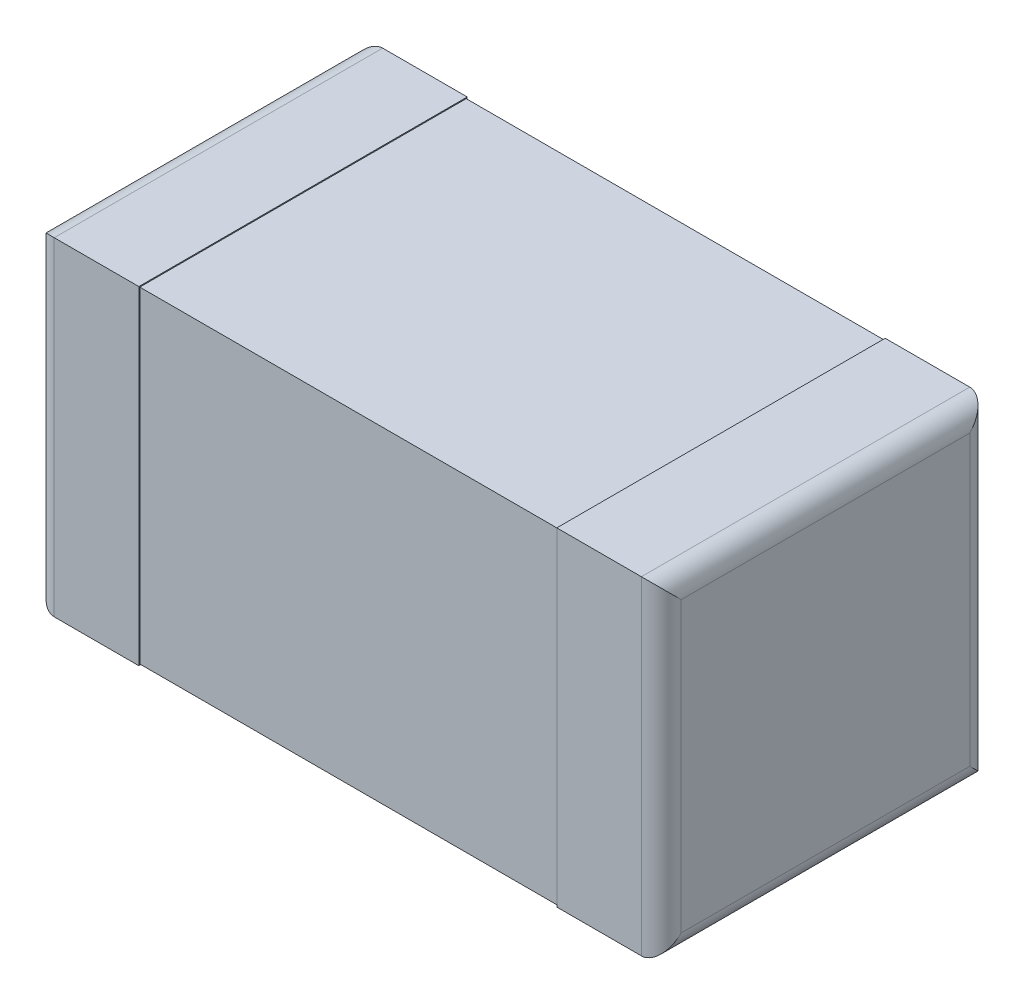
ISO-10303-21;
HEADER;
FILE_DESCRIPTION(('STEP AP214'),'2;1');
FILE_NAME('part.step','',(''),(''),'','','');
FILE_SCHEMA(('AUTOMOTIVE_DESIGN { 1 0 10303 214 1 1 1 1 }'));
ENDSEC;
DATA;
#1=APPLICATION_CONTEXT('core data for automotive mechanical design processes');
#2=APPLICATION_PROTOCOL_DEFINITION('international standard','automotive_design',2000,#1);
#3=PRODUCT_CONTEXT('',#1,'mechanical');
#4=PRODUCT('Part','Part','',(#3));
#5=PRODUCT_RELATED_PRODUCT_CATEGORY('part','',(#4));
#6=PRODUCT_DEFINITION_FORMATION('','',#4);
#7=PRODUCT_DEFINITION_CONTEXT('part definition',#1,'design');
#8=PRODUCT_DEFINITION('design','',#6,#7);
#9=PRODUCT_DEFINITION_SHAPE('','',#8);
#10=(LENGTH_UNIT() NAMED_UNIT(*) SI_UNIT(.MILLI.,.METRE.));
#11=(NAMED_UNIT(*) PLANE_ANGLE_UNIT() SI_UNIT($,.RADIAN.));
#12=(NAMED_UNIT(*) SI_UNIT($,.STERADIAN.) SOLID_ANGLE_UNIT());
#13=UNCERTAINTY_MEASURE_WITH_UNIT(LENGTH_MEASURE(1.E-05),#10,'distance_accuracy_value','');
#14=(GEOMETRIC_REPRESENTATION_CONTEXT(3) GLOBAL_UNCERTAINTY_ASSIGNED_CONTEXT((#13)) GLOBAL_UNIT_ASSIGNED_CONTEXT((#10,
#11,#12)) REPRESENTATION_CONTEXT('',''));
#15=CARTESIAN_POINT('',(0.,0.,0.));
#16=DIRECTION('',(0.,0.,1.));
#17=DIRECTION('',(1.,0.,0.));
#18=AXIS2_PLACEMENT_3D('',#15,#16,#17);
#19=CARTESIAN_POINT('',(0.,0.,0.));
#20=DIRECTION('',(0.,0.,1.));
#21=DIRECTION('',(1.,0.,0.));
#22=AXIS2_PLACEMENT_3D('',#19,#20,#21);
#23=PLANE('',#22);
#24=DIRECTION('',(-1.,0.,0.));
#25=VECTOR('',#24,1.);
#26=CARTESIAN_POINT('',(1.6002,0.8382,0.));
#27=LINE('',#26,#25);
#28=CARTESIAN_POINT('',(1.5494,0.8382,0.));
#29=VERTEX_POINT('',#28);
#30=CARTESIAN_POINT('',(1.3335,0.8382,0.));
#31=VERTEX_POINT('',#30);
#32=EDGE_CURVE('E42',#29,#31,#27,.T.);
#33=ORIENTED_EDGE('',*,*,#32,.F.);
#34=DIRECTION('',(0.,-1.,0.));
#35=VECTOR('',#34,1.);
#36=CARTESIAN_POINT('',(1.5494,0.,0.));
#37=LINE('',#36,#35);
#38=CARTESIAN_POINT('',(1.5494,0.,0.));
#39=VERTEX_POINT('',#38);
#40=EDGE_CURVE('E11',#29,#39,#37,.T.);
#41=ORIENTED_EDGE('',*,*,#40,.T.);
#42=DIRECTION('',(1.,0.,0.));
#43=VECTOR('',#42,1.);
#44=CARTESIAN_POINT('',(0.,0.,0.));
#45=LINE('',#44,#43);
#46=CARTESIAN_POINT('',(1.3335,0.,0.));
#47=VERTEX_POINT('',#46);
#48=EDGE_CURVE('E196',#47,#39,#45,.T.);
#49=ORIENTED_EDGE('',*,*,#48,.F.);
#50=DIRECTION('',(0.,1.,0.));
#51=VECTOR('',#50,1.);
#52=CARTESIAN_POINT('',(1.3335,0.,0.));
#53=LINE('',#52,#51);
#54=EDGE_CURVE('E29',#47,#31,#53,.T.);
#55=ORIENTED_EDGE('',*,*,#54,.T.);
#56=EDGE_LOOP('',(#33,#41,#49,#55));
#57=FACE_BOUND('',#56,.T.);
#58=ADVANCED_FACE('F18',(#57),#23,.F.);
#59=CARTESIAN_POINT('',(0.,0.,0.));
#60=DIRECTION('',(0.,0.,1.));
#61=DIRECTION('',(1.,0.,0.));
#62=AXIS2_PLACEMENT_3D('',#59,#60,#61);
#63=PLANE('',#62);
#64=DIRECTION('',(1.,0.,0.));
#65=VECTOR('',#64,1.);
#66=CARTESIAN_POINT('',(0.,0.,0.));
#67=LINE('',#66,#65);
#68=CARTESIAN_POINT('',(0.0508,0.,0.));
#69=VERTEX_POINT('',#68);
#70=CARTESIAN_POINT('',(0.2667,0.,0.));
#71=VERTEX_POINT('',#70);
#72=EDGE_CURVE('E268',#69,#71,#67,.T.);
#73=ORIENTED_EDGE('',*,*,#72,.F.);
#74=DIRECTION('',(0.,1.,0.));
#75=VECTOR('',#74,1.);
#76=CARTESIAN_POINT('',(0.0508,0.,0.));
#77=LINE('',#76,#75);
#78=CARTESIAN_POINT('',(0.0508,0.8382,0.));
#79=VERTEX_POINT('',#78);
#80=EDGE_CURVE('E290',#69,#79,#77,.T.);
#81=ORIENTED_EDGE('',*,*,#80,.T.);
#82=DIRECTION('',(-1.,0.,0.));
#83=VECTOR('',#82,1.);
#84=CARTESIAN_POINT('',(1.6002,0.8382,0.));
#85=LINE('',#84,#83);
#86=CARTESIAN_POINT('',(0.2667,0.8382,0.));
#87=VERTEX_POINT('',#86);
#88=EDGE_CURVE('E200',#87,#79,#85,.T.);
#89=ORIENTED_EDGE('',*,*,#88,.F.);
#90=DIRECTION('',(0.,-1.,0.));
#91=VECTOR('',#90,1.);
#92=CARTESIAN_POINT('',(0.2667,0.,0.));
#93=LINE('',#92,#91);
#94=EDGE_CURVE('E276',#87,#71,#93,.T.);
#95=ORIENTED_EDGE('',*,*,#94,.T.);
#96=EDGE_LOOP('',(#73,#81,#89,#95));
#97=FACE_BOUND('',#96,.T.);
#98=ADVANCED_FACE('F350',(#97),#63,.F.);
#99=CARTESIAN_POINT('',(1.3335,0.00254,-1.15577127423469));
#100=DIRECTION('',(0.,1.,0.));
#101=DIRECTION('',(1.,0.,0.));
#102=AXIS2_PLACEMENT_3D('',#99,#100,#101);
#103=PLANE('',#102);
#104=DIRECTION('',(-1.,0.,0.));
#105=VECTOR('',#104,1.);
#106=CARTESIAN_POINT('',(1.3335,0.00254,0.00253999999999988));
#107=LINE('',#106,#105);
#108=CARTESIAN_POINT('',(1.3335,0.00254000000000009,0.0025399999999999));
#109=VERTEX_POINT('',#108);
#110=CARTESIAN_POINT('',(0.2667,0.00254000000000009,0.0025399999999999));
#111=VERTEX_POINT('',#110);
#112=EDGE_CURVE('E226',#109,#111,#107,.T.);
#113=ORIENTED_EDGE('',*,*,#112,.F.);
#114=DIRECTION('',(0.,0.,1.));
#115=VECTOR('',#114,1.);
#116=CARTESIAN_POINT('',(1.3335,0.00254,-1.15577127423469));
#117=LINE('',#116,#115);
#118=CARTESIAN_POINT('',(1.3335,0.00254,0.83566));
#119=VERTEX_POINT('',#118);
#120=EDGE_CURVE('E272',#109,#119,#117,.T.);
#121=ORIENTED_EDGE('',*,*,#120,.T.);
#122=DIRECTION('',(-1.,0.,0.));
#123=VECTOR('',#122,1.);
#124=CARTESIAN_POINT('',(1.3335,0.00254,0.83566));
#125=LINE('',#124,#123);
#126=CARTESIAN_POINT('',(0.2667,0.00253999999999988,0.83566));
#127=VERTEX_POINT('',#126);
#128=EDGE_CURVE('E277',#119,#127,#125,.T.);
#129=ORIENTED_EDGE('',*,*,#128,.T.);
#130=DIRECTION('',(0.,0.,1.));
#131=VECTOR('',#130,1.);
#132=CARTESIAN_POINT('',(0.2667,0.00253999999999988,-1.15577127423469));
#133=LINE('',#132,#131);
#134=EDGE_CURVE('E434',#111,#127,#133,.T.);
#135=ORIENTED_EDGE('',*,*,#134,.F.);
#136=EDGE_LOOP('',(#113,#121,#129,#135));
#137=FACE_BOUND('',#136,.T.);
#138=ADVANCED_FACE('F355',(#137),#103,.F.);
#139=CARTESIAN_POINT('',(0.2667,0.83566,-1.15577127423469));
#140=DIRECTION('',(0.,-1.,0.));
#141=DIRECTION('',(0.,0.,-1.));
#142=AXIS2_PLACEMENT_3D('',#139,#140,#141);
#143=PLANE('',#142);
#144=DIRECTION('',(1.,0.,0.));
#145=VECTOR('',#144,1.);
#146=CARTESIAN_POINT('',(0.2667,0.83566,0.00253999999999988));
#147=LINE('',#146,#145);
#148=CARTESIAN_POINT('',(0.2667,0.83566,0.0025399999999999));
#149=VERTEX_POINT('',#148);
#150=CARTESIAN_POINT('',(1.3335,0.83566,0.0025399999999999));
#151=VERTEX_POINT('',#150);
#152=EDGE_CURVE('E247',#149,#151,#147,.T.);
#153=ORIENTED_EDGE('',*,*,#152,.F.);
#154=DIRECTION('',(0.,0.,1.));
#155=VECTOR('',#154,1.);
#156=CARTESIAN_POINT('',(0.2667,0.83566,-1.15577127423469));
#157=LINE('',#156,#155);
#158=CARTESIAN_POINT('',(0.2667,0.83566,0.83566));
#159=VERTEX_POINT('',#158);
#160=EDGE_CURVE('E445',#149,#159,#157,.T.);
#161=ORIENTED_EDGE('',*,*,#160,.T.);
#162=DIRECTION('',(1.,0.,0.));
#163=VECTOR('',#162,1.);
#164=CARTESIAN_POINT('',(0.2667,0.83566,0.83566));
#165=LINE('',#164,#163);
#166=CARTESIAN_POINT('',(1.3335,0.83566,0.83566));
#167=VERTEX_POINT('',#166);
#168=EDGE_CURVE('E264',#159,#167,#165,.T.);
#169=ORIENTED_EDGE('',*,*,#168,.T.);
#170=DIRECTION('',(0.,0.,1.));
#171=VECTOR('',#170,1.);
#172=CARTESIAN_POINT('',(1.3335,0.83566,-1.15577127423469));
#173=LINE('',#172,#171);
#174=EDGE_CURVE('E235',#151,#167,#173,.T.);
#175=ORIENTED_EDGE('',*,*,#174,.F.);
#176=EDGE_LOOP('',(#153,#161,#169,#175));
#177=FACE_BOUND('',#176,.T.);
#178=ADVANCED_FACE('F386',(#177),#143,.F.);
#179=CARTESIAN_POINT('',(1.6002,0.8382,0.8382));
#180=DIRECTION('',(0.,-1.,0.));
#181=DIRECTION('',(0.,0.,-1.));
#182=AXIS2_PLACEMENT_3D('',#179,#180,#181);
#183=PLANE('',#182);
#184=DIRECTION('',(-1.,0.,0.));
#185=VECTOR('',#184,1.);
#186=CARTESIAN_POINT('',(1.6002,0.8382,0.8382));
#187=LINE('',#186,#185);
#188=CARTESIAN_POINT('',(1.5494,0.8382,0.8382));
#189=VERTEX_POINT('',#188);
#190=CARTESIAN_POINT('',(1.3335,0.8382,0.8382));
#191=VERTEX_POINT('',#190);
#192=EDGE_CURVE('E180',#189,#191,#187,.T.);
#193=ORIENTED_EDGE('',*,*,#192,.F.);
#194=DIRECTION('',(0.,0.,-1.));
#195=VECTOR('',#194,1.);
#196=CARTESIAN_POINT('',(1.5494,0.8382,0.8382));
#197=LINE('',#196,#195);
#198=EDGE_CURVE('E261',#189,#29,#197,.T.);
#199=ORIENTED_EDGE('',*,*,#198,.T.);
#200=ORIENTED_EDGE('',*,*,#32,.T.);
#201=DIRECTION('',(0.,0.,1.));
#202=VECTOR('',#201,1.);
#203=CARTESIAN_POINT('',(1.3335,0.8382,0.83566));
#204=LINE('',#203,#202);
#205=EDGE_CURVE('E236',#31,#191,#204,.T.);
#206=ORIENTED_EDGE('',*,*,#205,.T.);
#207=EDGE_LOOP('',(#193,#199,#200,#206));
#208=FACE_BOUND('',#207,.T.);
#209=ADVANCED_FACE('F284',(#208),#183,.F.);
#210=CARTESIAN_POINT('',(0.,0.,0.8382));
#211=DIRECTION('',(0.,1.,0.));
#212=DIRECTION('',(1.,0.,0.));
#213=AXIS2_PLACEMENT_3D('',#210,#211,#212);
#214=PLANE('',#213);
#215=DIRECTION('',(1.,0.,0.));
#216=VECTOR('',#215,1.);
#217=CARTESIAN_POINT('',(0.,0.,0.8382));
#218=LINE('',#217,#216);
#219=CARTESIAN_POINT('',(0.0508,0.,0.8382));
#220=VERTEX_POINT('',#219);
#221=CARTESIAN_POINT('',(0.2667,0.,0.8382));
#222=VERTEX_POINT('',#221);
#223=EDGE_CURVE('E221',#220,#222,#218,.T.);
#224=ORIENTED_EDGE('',*,*,#223,.F.);
#225=DIRECTION('',(0.,0.,-1.));
#226=VECTOR('',#225,1.);
#227=CARTESIAN_POINT('',(0.0508,0.,0.8382));
#228=LINE('',#227,#226);
#229=EDGE_CURVE('E239',#220,#69,#228,.T.);
#230=ORIENTED_EDGE('',*,*,#229,.T.);
#231=ORIENTED_EDGE('',*,*,#72,.T.);
#232=DIRECTION('',(0.,0.,1.));
#233=VECTOR('',#232,1.);
#234=CARTESIAN_POINT('',(0.2667,0.,0.83566));
#235=LINE('',#234,#233);
#236=EDGE_CURVE('E279',#71,#222,#235,.T.);
#237=ORIENTED_EDGE('',*,*,#236,.T.);
#238=EDGE_LOOP('',(#224,#230,#231,#237));
#239=FACE_BOUND('',#238,.T.);
#240=ADVANCED_FACE('F401',(#239),#214,.F.);
#241=CARTESIAN_POINT('',(0.,0.,0.8382));
#242=DIRECTION('',(0.,1.,0.));
#243=DIRECTION('',(1.,0.,0.));
#244=AXIS2_PLACEMENT_3D('',#241,#242,#243);
#245=PLANE('',#244);
#246=ORIENTED_EDGE('',*,*,#48,.T.);
#247=DIRECTION('',(0.,0.,1.));
#248=VECTOR('',#247,1.);
#249=CARTESIAN_POINT('',(1.5494,0.,0.8382));
#250=LINE('',#249,#248);
#251=CARTESIAN_POINT('',(1.5494,0.,0.8382));
#252=VERTEX_POINT('',#251);
#253=EDGE_CURVE('E194',#39,#252,#250,.T.);
#254=ORIENTED_EDGE('',*,*,#253,.T.);
#255=DIRECTION('',(1.,0.,0.));
#256=VECTOR('',#255,1.);
#257=CARTESIAN_POINT('',(0.,0.,0.8382));
#258=LINE('',#257,#256);
#259=CARTESIAN_POINT('',(1.3335,0.,0.8382));
#260=VERTEX_POINT('',#259);
#261=EDGE_CURVE('E179',#260,#252,#258,.T.);
#262=ORIENTED_EDGE('',*,*,#261,.F.);
#263=DIRECTION('',(0.,0.,1.));
#264=VECTOR('',#263,1.);
#265=CARTESIAN_POINT('',(1.3335,0.,0.83566));
#266=LINE('',#265,#264);
#267=EDGE_CURVE('E223',#47,#260,#266,.T.);
#268=ORIENTED_EDGE('',*,*,#267,.F.);
#269=EDGE_LOOP('',(#246,#254,#262,#268));
#270=FACE_BOUND('',#269,.T.);
#271=ADVANCED_FACE('F20',(#270),#245,.F.);
#272=CARTESIAN_POINT('',(1.6002,0.8382,0.8382));
#273=DIRECTION('',(0.,-1.,0.));
#274=DIRECTION('',(0.,0.,-1.));
#275=AXIS2_PLACEMENT_3D('',#272,#273,#274);
#276=PLANE('',#275);
#277=ORIENTED_EDGE('',*,*,#88,.T.);
#278=DIRECTION('',(0.,0.,1.));
#279=VECTOR('',#278,1.);
#280=CARTESIAN_POINT('',(0.0508,0.8382,0.8382));
#281=LINE('',#280,#279);
#282=CARTESIAN_POINT('',(0.0508,0.8382,0.8382));
#283=VERTEX_POINT('',#282);
#284=EDGE_CURVE('E22',#79,#283,#281,.T.);
#285=ORIENTED_EDGE('',*,*,#284,.T.);
#286=DIRECTION('',(-1.,0.,0.));
#287=VECTOR('',#286,1.);
#288=CARTESIAN_POINT('',(1.6002,0.8382,0.8382));
#289=LINE('',#288,#287);
#290=CARTESIAN_POINT('',(0.2667,0.8382,0.8382));
#291=VERTEX_POINT('',#290);
#292=EDGE_CURVE('E269',#291,#283,#289,.T.);
#293=ORIENTED_EDGE('',*,*,#292,.F.);
#294=DIRECTION('',(0.,0.,1.));
#295=VECTOR('',#294,1.);
#296=CARTESIAN_POINT('',(0.2667,0.8382,0.83566));
#297=LINE('',#296,#295);
#298=EDGE_CURVE('E94',#87,#291,#297,.T.);
#299=ORIENTED_EDGE('',*,*,#298,.F.);
#300=EDGE_LOOP('',(#277,#285,#293,#299));
#301=FACE_BOUND('',#300,.T.);
#302=ADVANCED_FACE('F369',(#301),#276,.F.);
#303=CARTESIAN_POINT('',(0.,0.,0.8382));
#304=DIRECTION('',(0.,0.,1.));
#305=DIRECTION('',(1.,0.,0.));
#306=AXIS2_PLACEMENT_3D('',#303,#304,#305);
#307=PLANE('',#306);
#308=ORIENTED_EDGE('',*,*,#292,.T.);
#309=DIRECTION('',(0.,-1.,0.));
#310=VECTOR('',#309,1.);
#311=CARTESIAN_POINT('',(0.0508,0.,0.8382));
#312=LINE('',#311,#310);
#313=EDGE_CURVE('E77',#283,#220,#312,.T.);
#314=ORIENTED_EDGE('',*,*,#313,.T.);
#315=ORIENTED_EDGE('',*,*,#223,.T.);
#316=DIRECTION('',(0.,1.,0.));
#317=VECTOR('',#316,1.);
#318=CARTESIAN_POINT('',(0.2667,0.,0.8382));
#319=LINE('',#318,#317);
#320=EDGE_CURVE('E191',#222,#291,#319,.T.);
#321=ORIENTED_EDGE('',*,*,#320,.T.);
#322=EDGE_LOOP('',(#308,#314,#315,#321));
#323=FACE_BOUND('',#322,.T.);
#324=ADVANCED_FACE('F371',(#323),#307,.T.);
#325=CARTESIAN_POINT('',(0.,0.,0.8382));
#326=DIRECTION('',(0.,0.,1.));
#327=DIRECTION('',(1.,0.,0.));
#328=AXIS2_PLACEMENT_3D('',#325,#326,#327);
#329=PLANE('',#328);
#330=ORIENTED_EDGE('',*,*,#261,.T.);
#331=DIRECTION('',(0.,1.,0.));
#332=VECTOR('',#331,1.);
#333=CARTESIAN_POINT('',(1.5494,0.8382,0.8382));
#334=LINE('',#333,#332);
#335=EDGE_CURVE('E169',#252,#189,#334,.T.);
#336=ORIENTED_EDGE('',*,*,#335,.T.);
#337=ORIENTED_EDGE('',*,*,#192,.T.);
#338=DIRECTION('',(0.,-1.,0.));
#339=VECTOR('',#338,1.);
#340=CARTESIAN_POINT('',(1.3335,0.8382,0.8382));
#341=LINE('',#340,#339);
#342=EDGE_CURVE('E187',#191,#260,#341,.T.);
#343=ORIENTED_EDGE('',*,*,#342,.T.);
#344=EDGE_LOOP('',(#330,#336,#337,#343));
#345=FACE_BOUND('',#344,.T.);
#346=ADVANCED_FACE('F185',(#345),#329,.T.);
#347=CARTESIAN_POINT('',(0.,0.8382,0.8382));
#348=DIRECTION('',(1.,0.,0.));
#349=DIRECTION('',(0.,1.,0.));
#350=AXIS2_PLACEMENT_3D('',#347,#348,#349);
#351=PLANE('',#350);
#352=DIRECTION('',(0.,-1.,0.));
#353=VECTOR('',#352,1.);
#354=CARTESIAN_POINT('',(0.,0.8382,0.0508));
#355=LINE('',#354,#353);
#356=CARTESIAN_POINT('',(0.,0.7874,0.0508));
#357=VERTEX_POINT('',#356);
#358=CARTESIAN_POINT('',(0.,0.0508,0.0508));
#359=VERTEX_POINT('',#358);
#360=EDGE_CURVE('E256',#357,#359,#355,.T.);
#361=ORIENTED_EDGE('',*,*,#360,.T.);
#362=DIRECTION('',(0.,0.,1.));
#363=VECTOR('',#362,1.);
#364=CARTESIAN_POINT('',(0.,0.0508,0.8382));
#365=LINE('',#364,#363);
#366=CARTESIAN_POINT('',(0.,0.0508,0.7874));
#367=VERTEX_POINT('',#366);
#368=EDGE_CURVE('E413',#359,#367,#365,.T.);
#369=ORIENTED_EDGE('',*,*,#368,.T.);
#370=DIRECTION('',(0.,1.,0.));
#371=VECTOR('',#370,1.);
#372=CARTESIAN_POINT('',(0.,0.8382,0.7874));
#373=LINE('',#372,#371);
#374=CARTESIAN_POINT('',(0.,0.7874,0.7874));
#375=VERTEX_POINT('',#374);
#376=EDGE_CURVE('E230',#367,#375,#373,.T.);
#377=ORIENTED_EDGE('',*,*,#376,.T.);
#378=DIRECTION('',(0.,0.,-1.));
#379=VECTOR('',#378,1.);
#380=CARTESIAN_POINT('',(0.,0.7874,0.8382));
#381=LINE('',#380,#379);
#382=EDGE_CURVE('E227',#375,#357,#381,.T.);
#383=ORIENTED_EDGE('',*,*,#382,.T.);
#384=EDGE_LOOP('',(#361,#369,#377,#383));
#385=FACE_BOUND('',#384,.T.);
#386=ADVANCED_FACE('F376',(#385),#351,.F.);
#387=CARTESIAN_POINT('',(1.6002,0.,0.8382));
#388=DIRECTION('',(-1.,0.,0.));
#389=DIRECTION('',(0.,0.,1.));
#390=AXIS2_PLACEMENT_3D('',#387,#388,#389);
#391=PLANE('',#390);
#392=DIRECTION('',(0.,1.,0.));
#393=VECTOR('',#392,1.);
#394=CARTESIAN_POINT('',(1.6002,0.,0.0508));
#395=LINE('',#394,#393);
#396=CARTESIAN_POINT('',(1.6002,0.0508,0.0508));
#397=VERTEX_POINT('',#396);
#398=CARTESIAN_POINT('',(1.6002,0.7874,0.0508));
#399=VERTEX_POINT('',#398);
#400=EDGE_CURVE('E231',#397,#399,#395,.T.);
#401=ORIENTED_EDGE('',*,*,#400,.T.);
#402=DIRECTION('',(0.,0.,1.));
#403=VECTOR('',#402,1.);
#404=CARTESIAN_POINT('',(1.6002,0.7874,0.8382));
#405=LINE('',#404,#403);
#406=CARTESIAN_POINT('',(1.6002,0.7874,0.7874));
#407=VERTEX_POINT('',#406);
#408=EDGE_CURVE('E440',#399,#407,#405,.T.);
#409=ORIENTED_EDGE('',*,*,#408,.T.);
#410=DIRECTION('',(0.,-1.,0.));
#411=VECTOR('',#410,1.);
#412=CARTESIAN_POINT('',(1.6002,0.,0.7874));
#413=LINE('',#412,#411);
#414=CARTESIAN_POINT('',(1.6002,0.0508,0.7874));
#415=VERTEX_POINT('',#414);
#416=EDGE_CURVE('E243',#407,#415,#413,.T.);
#417=ORIENTED_EDGE('',*,*,#416,.T.);
#418=DIRECTION('',(0.,0.,-1.));
#419=VECTOR('',#418,1.);
#420=CARTESIAN_POINT('',(1.6002,0.0508,0.8382));
#421=LINE('',#420,#419);
#422=EDGE_CURVE('E203',#415,#397,#421,.T.);
#423=ORIENTED_EDGE('',*,*,#422,.T.);
#424=EDGE_LOOP('',(#401,#409,#417,#423));
#425=FACE_BOUND('',#424,.T.);
#426=ADVANCED_FACE('F343',(#425),#391,.F.);
#427=CARTESIAN_POINT('',(0.2667,0.,0.83566));
#428=DIRECTION('',(1.,0.,0.));
#429=DIRECTION('',(0.,1.,0.));
#430=AXIS2_PLACEMENT_3D('',#427,#428,#429);
#431=PLANE('',#430);
#432=ORIENTED_EDGE('',*,*,#160,.F.);
#433=DIRECTION('',(0.,-1.,0.));
#434=VECTOR('',#433,1.);
#435=CARTESIAN_POINT('',(0.2667,1.99143127423469,0.0025399999999999));
#436=LINE('',#435,#434);
#437=EDGE_CURVE('E244',#149,#111,#436,.T.);
#438=ORIENTED_EDGE('',*,*,#437,.T.);
#439=ORIENTED_EDGE('',*,*,#134,.T.);
#440=DIRECTION('',(0.,1.,0.));
#441=VECTOR('',#440,1.);
#442=CARTESIAN_POINT('',(0.2667,0.,0.83566));
#443=LINE('',#442,#441);
#444=EDGE_CURVE('E431',#127,#159,#443,.T.);
#445=ORIENTED_EDGE('',*,*,#444,.T.);
#446=EDGE_LOOP('',(#432,#438,#439,#445));
#447=FACE_BOUND('',#446,.T.);
#448=ORIENTED_EDGE('',*,*,#298,.T.);
#449=ORIENTED_EDGE('',*,*,#320,.F.);
#450=ORIENTED_EDGE('',*,*,#236,.F.);
#451=ORIENTED_EDGE('',*,*,#94,.F.);
#452=EDGE_LOOP('',(#448,#449,#450,#451));
#453=FACE_BOUND('',#452,.T.);
#454=ADVANCED_FACE('F332',(#447,#453),#431,.T.);
#455=CARTESIAN_POINT('',(1.3335,0.8382,0.83566));
#456=DIRECTION('',(-1.,0.,0.));
#457=DIRECTION('',(0.,0.,1.));
#458=AXIS2_PLACEMENT_3D('',#455,#456,#457);
#459=PLANE('',#458);
#460=DIRECTION('',(0.,-1.,0.));
#461=VECTOR('',#460,1.);
#462=CARTESIAN_POINT('',(1.3335,1.99143127423469,0.0025399999999999));
#463=LINE('',#462,#461);
#464=EDGE_CURVE('E250',#151,#109,#463,.T.);
#465=ORIENTED_EDGE('',*,*,#464,.F.);
#466=ORIENTED_EDGE('',*,*,#174,.T.);
#467=DIRECTION('',(0.,-1.,0.));
#468=VECTOR('',#467,1.);
#469=CARTESIAN_POINT('',(1.3335,0.8382,0.83566));
#470=LINE('',#469,#468);
#471=EDGE_CURVE('E225',#167,#119,#470,.T.);
#472=ORIENTED_EDGE('',*,*,#471,.T.);
#473=ORIENTED_EDGE('',*,*,#120,.F.);
#474=EDGE_LOOP('',(#465,#466,#472,#473));
#475=FACE_BOUND('',#474,.T.);
#476=ORIENTED_EDGE('',*,*,#267,.T.);
#477=ORIENTED_EDGE('',*,*,#342,.F.);
#478=ORIENTED_EDGE('',*,*,#205,.F.);
#479=ORIENTED_EDGE('',*,*,#54,.F.);
#480=EDGE_LOOP('',(#476,#477,#478,#479));
#481=FACE_BOUND('',#480,.T.);
#482=ADVANCED_FACE('F292',(#475,#481),#459,.T.);
#483=CARTESIAN_POINT('',(0.,0.,0.83566));
#484=DIRECTION('',(0.,0.,-1.));
#485=DIRECTION('',(0.,-1.,0.));
#486=AXIS2_PLACEMENT_3D('',#483,#484,#485);
#487=PLANE('',#486);
#488=ORIENTED_EDGE('',*,*,#471,.F.);
#489=ORIENTED_EDGE('',*,*,#168,.F.);
#490=ORIENTED_EDGE('',*,*,#444,.F.);
#491=ORIENTED_EDGE('',*,*,#128,.F.);
#492=EDGE_LOOP('',(#488,#489,#490,#491));
#493=FACE_BOUND('',#492,.T.);
#494=ADVANCED_FACE('F331',(#493),#487,.F.);
#495=CARTESIAN_POINT('',(0.2667,1.99143127423469,0.0025399999999999));
#496=DIRECTION('',(0.,0.,-1.));
#497=DIRECTION('',(0.,-1.,0.));
#498=AXIS2_PLACEMENT_3D('',#495,#496,#497);
#499=PLANE('',#498);
#500=ORIENTED_EDGE('',*,*,#112,.T.);
#501=ORIENTED_EDGE('',*,*,#437,.F.);
#502=ORIENTED_EDGE('',*,*,#152,.T.);
#503=ORIENTED_EDGE('',*,*,#464,.T.);
#504=EDGE_LOOP('',(#500,#501,#502,#503));
#505=FACE_BOUND('',#504,.T.);
#506=ADVANCED_FACE('F340',(#505),#499,.T.);
#507=CARTESIAN_POINT('',(0.0508,0.7874,0.8382));
#508=DIRECTION('',(0.,0.,-1.));
#509=DIRECTION('',(-1.,0.,0.));
#510=AXIS2_PLACEMENT_3D('',#507,#508,#509);
#511=CYLINDRICAL_SURFACE('',#510,0.0508);
#512=CARTESIAN_POINT('',(0.0508,0.7874,0.0508));
#513=DIRECTION('',(0.,-0.707106781186548,-0.707106781186548));
#514=DIRECTION('',(0.,0.707106781186548,-0.707106781186548));
#515=AXIS2_PLACEMENT_3D('',#512,#513,#514);
#516=ELLIPSE('',#515,0.0718420489685533,0.0508);
#517=EDGE_CURVE('E439',#357,#79,#516,.T.);
#518=ORIENTED_EDGE('',*,*,#517,.F.);
#519=ORIENTED_EDGE('',*,*,#382,.F.);
#520=CARTESIAN_POINT('',(0.0508,0.7874,0.7874));
#521=DIRECTION('',(0.,-0.707106781186548,0.707106781186548));
#522=DIRECTION('',(0.,-0.707106781186548,-0.707106781186548));
#523=AXIS2_PLACEMENT_3D('',#520,#521,#522);
#524=ELLIPSE('',#523,0.0718420489685533,0.0508);
#525=EDGE_CURVE('E489',#283,#375,#524,.T.);
#526=ORIENTED_EDGE('',*,*,#525,.F.);
#527=ORIENTED_EDGE('',*,*,#284,.F.);
#528=EDGE_LOOP('',(#518,#519,#526,#527));
#529=FACE_BOUND('',#528,.T.);
#530=ADVANCED_FACE('F361',(#529),#511,.T.);
#531=CARTESIAN_POINT('',(0.0508,0.,0.7874));
#532=DIRECTION('',(0.,1.,0.));
#533=DIRECTION('',(-1.,0.,0.));
#534=AXIS2_PLACEMENT_3D('',#531,#532,#533);
#535=CYLINDRICAL_SURFACE('',#534,0.0508);
#536=ORIENTED_EDGE('',*,*,#525,.T.);
#537=ORIENTED_EDGE('',*,*,#376,.F.);
#538=CARTESIAN_POINT('',(0.0508,0.0508,0.7874));
#539=DIRECTION('',(0.,-0.707106781186548,-0.707106781186548));
#540=DIRECTION('',(0.,0.707106781186548,-0.707106781186548));
#541=AXIS2_PLACEMENT_3D('',#538,#539,#540);
#542=ELLIPSE('',#541,0.0718420489685533,0.0508);
#543=EDGE_CURVE('E214',#220,#367,#542,.T.);
#544=ORIENTED_EDGE('',*,*,#543,.F.);
#545=ORIENTED_EDGE('',*,*,#313,.F.);
#546=EDGE_LOOP('',(#536,#537,#544,#545));
#547=FACE_BOUND('',#546,.T.);
#548=ADVANCED_FACE('F364',(#547),#535,.T.);
#549=CARTESIAN_POINT('',(0.0508,0.8382,0.0508));
#550=DIRECTION('',(0.,-1.,0.));
#551=DIRECTION('',(1.,0.,0.));
#552=AXIS2_PLACEMENT_3D('',#549,#550,#551);
#553=CYLINDRICAL_SURFACE('',#552,0.0508);
#554=ORIENTED_EDGE('',*,*,#517,.T.);
#555=ORIENTED_EDGE('',*,*,#80,.F.);
#556=CARTESIAN_POINT('',(0.0508,0.0508,0.0508));
#557=DIRECTION('',(0.,-0.707106781186548,0.707106781186548));
#558=DIRECTION('',(0.,-0.707106781186548,-0.707106781186548));
#559=AXIS2_PLACEMENT_3D('',#556,#557,#558);
#560=ELLIPSE('',#559,0.0718420489685533,0.0508);
#561=EDGE_CURVE('E206',#359,#69,#560,.T.);
#562=ORIENTED_EDGE('',*,*,#561,.F.);
#563=ORIENTED_EDGE('',*,*,#360,.F.);
#564=EDGE_LOOP('',(#554,#555,#562,#563));
#565=FACE_BOUND('',#564,.T.);
#566=ADVANCED_FACE('F368',(#565),#553,.T.);
#567=CARTESIAN_POINT('',(0.0508,0.0508,0.8382));
#568=DIRECTION('',(0.,0.,-1.));
#569=DIRECTION('',(-1.,0.,0.));
#570=AXIS2_PLACEMENT_3D('',#567,#568,#569);
#571=CYLINDRICAL_SURFACE('',#570,0.0508);
#572=ORIENTED_EDGE('',*,*,#543,.T.);
#573=ORIENTED_EDGE('',*,*,#368,.F.);
#574=ORIENTED_EDGE('',*,*,#561,.T.);
#575=ORIENTED_EDGE('',*,*,#229,.F.);
#576=EDGE_LOOP('',(#572,#573,#574,#575));
#577=FACE_BOUND('',#576,.T.);
#578=ADVANCED_FACE('F360',(#577),#571,.T.);
#579=CARTESIAN_POINT('',(1.5494,0.0508,0.8382));
#580=DIRECTION('',(0.,0.,-1.));
#581=DIRECTION('',(-1.,0.,0.));
#582=AXIS2_PLACEMENT_3D('',#579,#580,#581);
#583=CYLINDRICAL_SURFACE('',#582,0.0508);
#584=CARTESIAN_POINT('',(1.5494,0.0508,0.0508));
#585=DIRECTION('',(0.,0.707106781186548,-0.707106781186548));
#586=DIRECTION('',(0.,-0.707106781186548,-0.707106781186548));
#587=AXIS2_PLACEMENT_3D('',#584,#585,#586);
#588=ELLIPSE('',#587,0.0718420489685533,0.0508);
#589=EDGE_CURVE('E207',#397,#39,#588,.T.);
#590=ORIENTED_EDGE('',*,*,#589,.F.);
#591=ORIENTED_EDGE('',*,*,#422,.F.);
#592=CARTESIAN_POINT('',(1.5494,0.0508,0.7874));
#593=DIRECTION('',(0.,0.707106781186548,0.707106781186548));
#594=DIRECTION('',(0.,0.707106781186548,-0.707106781186548));
#595=AXIS2_PLACEMENT_3D('',#592,#593,#594);
#596=ELLIPSE('',#595,0.0718420489685533,0.0508);
#597=EDGE_CURVE('E173',#252,#415,#596,.T.);
#598=ORIENTED_EDGE('',*,*,#597,.F.);
#599=ORIENTED_EDGE('',*,*,#253,.F.);
#600=EDGE_LOOP('',(#590,#591,#598,#599));
#601=FACE_BOUND('',#600,.T.);
#602=ADVANCED_FACE('F202',(#601),#583,.T.);
#603=CARTESIAN_POINT('',(1.5494,0.,0.7874));
#604=DIRECTION('',(0.,-1.,0.));
#605=DIRECTION('',(0.,0.,-1.));
#606=AXIS2_PLACEMENT_3D('',#603,#604,#605);
#607=CYLINDRICAL_SURFACE('',#606,0.0508);
#608=ORIENTED_EDGE('',*,*,#597,.T.);
#609=ORIENTED_EDGE('',*,*,#416,.F.);
#610=CARTESIAN_POINT('',(1.5494,0.7874,0.7874));
#611=DIRECTION('',(0.,0.707106781186548,-0.707106781186548));
#612=DIRECTION('',(0.,-0.707106781186548,-0.707106781186548));
#613=AXIS2_PLACEMENT_3D('',#610,#611,#612);
#614=ELLIPSE('',#613,0.0718420489685533,0.0508);
#615=EDGE_CURVE('E175',#189,#407,#614,.T.);
#616=ORIENTED_EDGE('',*,*,#615,.F.);
#617=ORIENTED_EDGE('',*,*,#335,.F.);
#618=EDGE_LOOP('',(#608,#609,#616,#617));
#619=FACE_BOUND('',#618,.T.);
#620=ADVANCED_FACE('F171',(#619),#607,.T.);
#621=CARTESIAN_POINT('',(1.5494,0.,0.0508));
#622=DIRECTION('',(0.,1.,0.));
#623=DIRECTION('',(0.,0.,1.));
#624=AXIS2_PLACEMENT_3D('',#621,#622,#623);
#625=CYLINDRICAL_SURFACE('',#624,0.0508);
#626=ORIENTED_EDGE('',*,*,#589,.T.);
#627=ORIENTED_EDGE('',*,*,#40,.F.);
#628=CARTESIAN_POINT('',(1.5494,0.7874,0.0508));
#629=DIRECTION('',(0.,0.707106781186548,0.707106781186548));
#630=DIRECTION('',(0.,0.707106781186548,-0.707106781186548));
#631=AXIS2_PLACEMENT_3D('',#628,#629,#630);
#632=ELLIPSE('',#631,0.0718420489685533,0.0508);
#633=EDGE_CURVE('E257',#399,#29,#632,.T.);
#634=ORIENTED_EDGE('',*,*,#633,.F.);
#635=ORIENTED_EDGE('',*,*,#400,.F.);
#636=EDGE_LOOP('',(#626,#627,#634,#635));
#637=FACE_BOUND('',#636,.T.);
#638=ADVANCED_FACE('F396',(#637),#625,.T.);
#639=CARTESIAN_POINT('',(1.5494,0.7874,0.8382));
#640=DIRECTION('',(0.,0.,-1.));
#641=DIRECTION('',(-1.,0.,0.));
#642=AXIS2_PLACEMENT_3D('',#639,#640,#641);
#643=CYLINDRICAL_SURFACE('',#642,0.0508);
#644=ORIENTED_EDGE('',*,*,#615,.T.);
#645=ORIENTED_EDGE('',*,*,#408,.F.);
#646=ORIENTED_EDGE('',*,*,#633,.T.);
#647=ORIENTED_EDGE('',*,*,#198,.F.);
#648=EDGE_LOOP('',(#644,#645,#646,#647));
#649=FACE_BOUND('',#648,.T.);
#650=ADVANCED_FACE('F399',(#649),#643,.T.);
#651=CLOSED_SHELL('',(#58,#98,#138,#178,#209,#240,#271,#302,#324,#346,#386,#426,#454,#482,#494,
#506,#530,#548,#566,#578,#602,#620,#638,#650));
#652=MANIFOLD_SOLID_BREP('B1',#651);
#653=ADVANCED_BREP_SHAPE_REPRESENTATION('',(#18,#652),#14);
#654=SHAPE_DEFINITION_REPRESENTATION(#9,#653);
ENDSEC;
END-ISO-10303-21;
